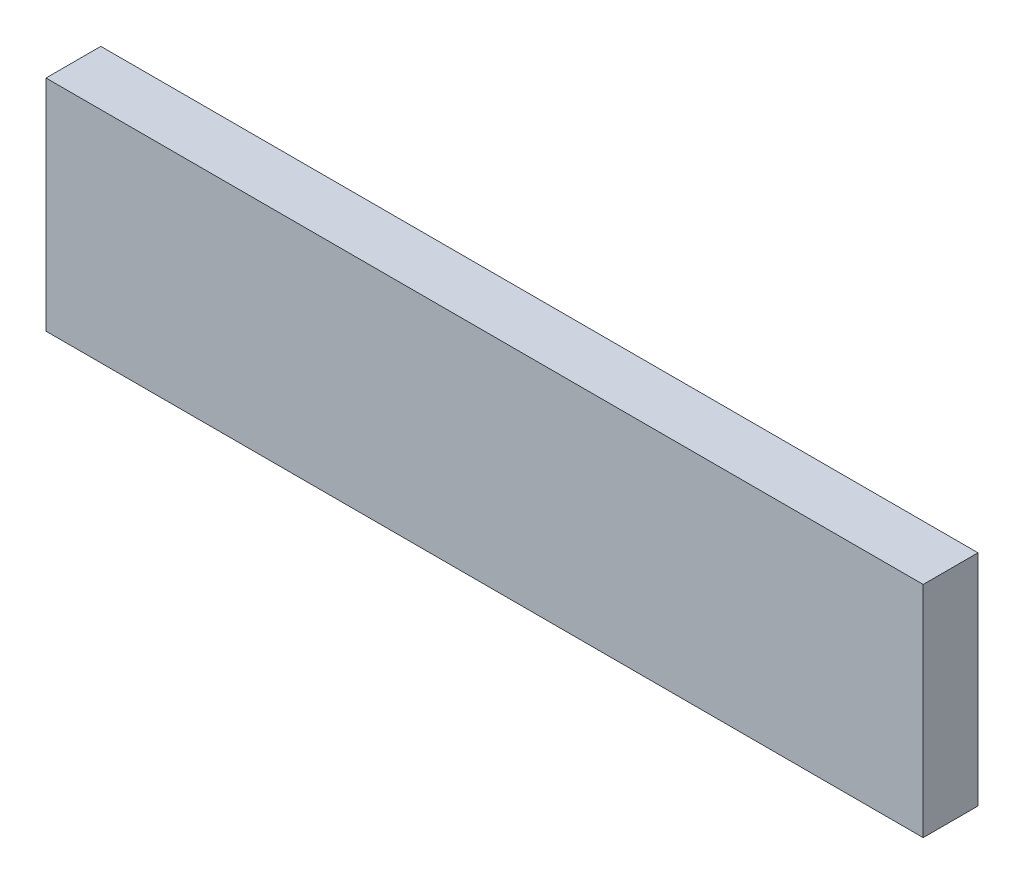
ISO-10303-21;
HEADER;
FILE_DESCRIPTION(('STEP AP214'),'2;1');
FILE_NAME('part.step','',(''),(''),'','','');
FILE_SCHEMA(('AUTOMOTIVE_DESIGN { 1 0 10303 214 1 1 1 1 }'));
ENDSEC;
DATA;
#1=APPLICATION_CONTEXT('core data for automotive mechanical design processes');
#2=APPLICATION_PROTOCOL_DEFINITION('international standard','automotive_design',2000,#1);
#3=PRODUCT_CONTEXT('',#1,'mechanical');
#4=PRODUCT('Part','Part','',(#3));
#5=PRODUCT_RELATED_PRODUCT_CATEGORY('part','',(#4));
#6=PRODUCT_DEFINITION_FORMATION('','',#4);
#7=PRODUCT_DEFINITION_CONTEXT('part definition',#1,'design');
#8=PRODUCT_DEFINITION('design','',#6,#7);
#9=PRODUCT_DEFINITION_SHAPE('','',#8);
#10=(LENGTH_UNIT() NAMED_UNIT(*) SI_UNIT(.MILLI.,.METRE.));
#11=(NAMED_UNIT(*) PLANE_ANGLE_UNIT() SI_UNIT($,.RADIAN.));
#12=(NAMED_UNIT(*) SI_UNIT($,.STERADIAN.) SOLID_ANGLE_UNIT());
#13=UNCERTAINTY_MEASURE_WITH_UNIT(LENGTH_MEASURE(1.E-05),#10,'distance_accuracy_value','');
#14=(GEOMETRIC_REPRESENTATION_CONTEXT(3) GLOBAL_UNCERTAINTY_ASSIGNED_CONTEXT((#13)) GLOBAL_UNIT_ASSIGNED_CONTEXT((#10,
#11,#12)) REPRESENTATION_CONTEXT('',''));
#15=CARTESIAN_POINT('',(0.,0.,0.));
#16=DIRECTION('',(0.,0.,1.));
#17=DIRECTION('',(1.,0.,0.));
#18=AXIS2_PLACEMENT_3D('',#15,#16,#17);
#19=CARTESIAN_POINT('',(0.,0.,-6.35));
#20=DIRECTION('',(-1.,0.,0.));
#21=DIRECTION('',(0.,0.,1.));
#22=AXIS2_PLACEMENT_3D('',#19,#20,#21);
#23=PLANE('',#22);
#24=DIRECTION('',(0.,-1.,0.));
#25=VECTOR('',#24,1.);
#26=CARTESIAN_POINT('',(0.,0.,0.));
#27=LINE('',#26,#25);
#28=CARTESIAN_POINT('',(0.,25.4,0.));
#29=VERTEX_POINT('',#28);
#30=CARTESIAN_POINT('',(0.,0.,0.));
#31=VERTEX_POINT('',#30);
#32=EDGE_CURVE('E100',#29,#31,#27,.T.);
#33=ORIENTED_EDGE('',*,*,#32,.F.);
#34=DIRECTION('',(0.,0.,1.));
#35=VECTOR('',#34,1.);
#36=CARTESIAN_POINT('',(0.,25.4,-6.35));
#37=LINE('',#36,#35);
#38=CARTESIAN_POINT('',(0.,25.4,-6.35));
#39=VERTEX_POINT('',#38);
#40=EDGE_CURVE('E11',#39,#29,#37,.T.);
#41=ORIENTED_EDGE('',*,*,#40,.F.);
#42=DIRECTION('',(0.,-1.,0.));
#43=VECTOR('',#42,1.);
#44=CARTESIAN_POINT('',(0.,0.,-6.35));
#45=LINE('',#44,#43);
#46=CARTESIAN_POINT('',(0.,0.,-6.35));
#47=VERTEX_POINT('',#46);
#48=EDGE_CURVE('E94',#39,#47,#45,.T.);
#49=ORIENTED_EDGE('',*,*,#48,.T.);
#50=DIRECTION('',(0.,0.,1.));
#51=VECTOR('',#50,1.);
#52=CARTESIAN_POINT('',(0.,0.,-6.35));
#53=LINE('',#52,#51);
#54=EDGE_CURVE('E39',#47,#31,#53,.T.);
#55=ORIENTED_EDGE('',*,*,#54,.T.);
#56=EDGE_LOOP('',(#33,#41,#49,#55));
#57=FACE_BOUND('',#56,.T.);
#58=ADVANCED_FACE('F36',(#57),#23,.T.);
#59=CARTESIAN_POINT('',(0.,25.4,-6.35));
#60=DIRECTION('',(0.,1.,0.));
#61=DIRECTION('',(0.,0.,1.));
#62=AXIS2_PLACEMENT_3D('',#59,#60,#61);
#63=PLANE('',#62);
#64=DIRECTION('',(-1.,0.,0.));
#65=VECTOR('',#64,1.);
#66=CARTESIAN_POINT('',(0.,25.4,0.));
#67=LINE('',#66,#65);
#68=CARTESIAN_POINT('',(101.6,25.4,0.));
#69=VERTEX_POINT('',#68);
#70=EDGE_CURVE('E96',#69,#29,#67,.T.);
#71=ORIENTED_EDGE('',*,*,#70,.F.);
#72=DIRECTION('',(0.,0.,1.));
#73=VECTOR('',#72,1.);
#74=CARTESIAN_POINT('',(101.6,25.4,-6.35));
#75=LINE('',#74,#73);
#76=CARTESIAN_POINT('',(101.6,25.4,-6.35));
#77=VERTEX_POINT('',#76);
#78=EDGE_CURVE('E45',#77,#69,#75,.T.);
#79=ORIENTED_EDGE('',*,*,#78,.F.);
#80=DIRECTION('',(-1.,0.,0.));
#81=VECTOR('',#80,1.);
#82=CARTESIAN_POINT('',(0.,25.4,-6.35));
#83=LINE('',#82,#81);
#84=EDGE_CURVE('E91',#77,#39,#83,.T.);
#85=ORIENTED_EDGE('',*,*,#84,.T.);
#86=ORIENTED_EDGE('',*,*,#40,.T.);
#87=EDGE_LOOP('',(#71,#79,#85,#86));
#88=FACE_BOUND('',#87,.T.);
#89=ADVANCED_FACE('F110',(#88),#63,.T.);
#90=CARTESIAN_POINT('',(101.6,0.,-6.35));
#91=DIRECTION('',(1.,0.,0.));
#92=DIRECTION('',(0.,0.,-1.));
#93=AXIS2_PLACEMENT_3D('',#90,#91,#92);
#94=PLANE('',#93);
#95=DIRECTION('',(0.,1.,0.));
#96=VECTOR('',#95,1.);
#97=CARTESIAN_POINT('',(101.6,0.,0.));
#98=LINE('',#97,#96);
#99=CARTESIAN_POINT('',(101.6,0.,0.));
#100=VERTEX_POINT('',#99);
#101=EDGE_CURVE('E86',#100,#69,#98,.T.);
#102=ORIENTED_EDGE('',*,*,#101,.F.);
#103=DIRECTION('',(0.,0.,1.));
#104=VECTOR('',#103,1.);
#105=CARTESIAN_POINT('',(101.6,0.,-6.35));
#106=LINE('',#105,#104);
#107=CARTESIAN_POINT('',(101.6,0.,-6.35));
#108=VERTEX_POINT('',#107);
#109=EDGE_CURVE('E81',#108,#100,#106,.T.);
#110=ORIENTED_EDGE('',*,*,#109,.F.);
#111=DIRECTION('',(0.,1.,0.));
#112=VECTOR('',#111,1.);
#113=CARTESIAN_POINT('',(101.6,0.,-6.35));
#114=LINE('',#113,#112);
#115=EDGE_CURVE('E84',#108,#77,#114,.T.);
#116=ORIENTED_EDGE('',*,*,#115,.T.);
#117=ORIENTED_EDGE('',*,*,#78,.T.);
#118=EDGE_LOOP('',(#102,#110,#116,#117));
#119=FACE_BOUND('',#118,.T.);
#120=ADVANCED_FACE('F83',(#119),#94,.T.);
#121=CARTESIAN_POINT('',(0.,0.,-6.35));
#122=DIRECTION('',(0.,-1.,0.));
#123=DIRECTION('',(0.,0.,-1.));
#124=AXIS2_PLACEMENT_3D('',#121,#122,#123);
#125=PLANE('',#124);
#126=DIRECTION('',(1.,0.,0.));
#127=VECTOR('',#126,1.);
#128=CARTESIAN_POINT('',(0.,0.,0.));
#129=LINE('',#128,#127);
#130=EDGE_CURVE('E103',#31,#100,#129,.T.);
#131=ORIENTED_EDGE('',*,*,#130,.F.);
#132=ORIENTED_EDGE('',*,*,#54,.F.);
#133=DIRECTION('',(1.,0.,0.));
#134=VECTOR('',#133,1.);
#135=CARTESIAN_POINT('',(0.,0.,-6.35));
#136=LINE('',#135,#134);
#137=EDGE_CURVE('E90',#47,#108,#136,.T.);
#138=ORIENTED_EDGE('',*,*,#137,.T.);
#139=ORIENTED_EDGE('',*,*,#109,.T.);
#140=EDGE_LOOP('',(#131,#132,#138,#139));
#141=FACE_BOUND('',#140,.T.);
#142=ADVANCED_FACE('F93',(#141),#125,.T.);
#143=CARTESIAN_POINT('',(0.,25.4,-6.35));
#144=DIRECTION('',(0.,0.,-1.));
#145=DIRECTION('',(-1.,0.,0.));
#146=AXIS2_PLACEMENT_3D('',#143,#144,#145);
#147=PLANE('',#146);
#148=ORIENTED_EDGE('',*,*,#48,.F.);
#149=ORIENTED_EDGE('',*,*,#84,.F.);
#150=ORIENTED_EDGE('',*,*,#115,.F.);
#151=ORIENTED_EDGE('',*,*,#137,.F.);
#152=EDGE_LOOP('',(#148,#149,#150,#151));
#153=FACE_BOUND('',#152,.T.);
#154=ADVANCED_FACE('F89',(#153),#147,.T.);
#155=CARTESIAN_POINT('',(0.,25.4,0.));
#156=DIRECTION('',(0.,0.,-1.));
#157=DIRECTION('',(-1.,0.,0.));
#158=AXIS2_PLACEMENT_3D('',#155,#156,#157);
#159=PLANE('',#158);
#160=ORIENTED_EDGE('',*,*,#32,.T.);
#161=ORIENTED_EDGE('',*,*,#130,.T.);
#162=ORIENTED_EDGE('',*,*,#101,.T.);
#163=ORIENTED_EDGE('',*,*,#70,.T.);
#164=EDGE_LOOP('',(#160,#161,#162,#163));
#165=FACE_BOUND('',#164,.T.);
#166=ADVANCED_FACE('F109',(#165),#159,.F.);
#167=CLOSED_SHELL('',(#58,#89,#120,#142,#154,#166));
#168=MANIFOLD_SOLID_BREP('B2',#167);
#169=ADVANCED_BREP_SHAPE_REPRESENTATION('',(#18,#168),#14);
#170=SHAPE_DEFINITION_REPRESENTATION(#9,#169);
ENDSEC;
END-ISO-10303-21;
